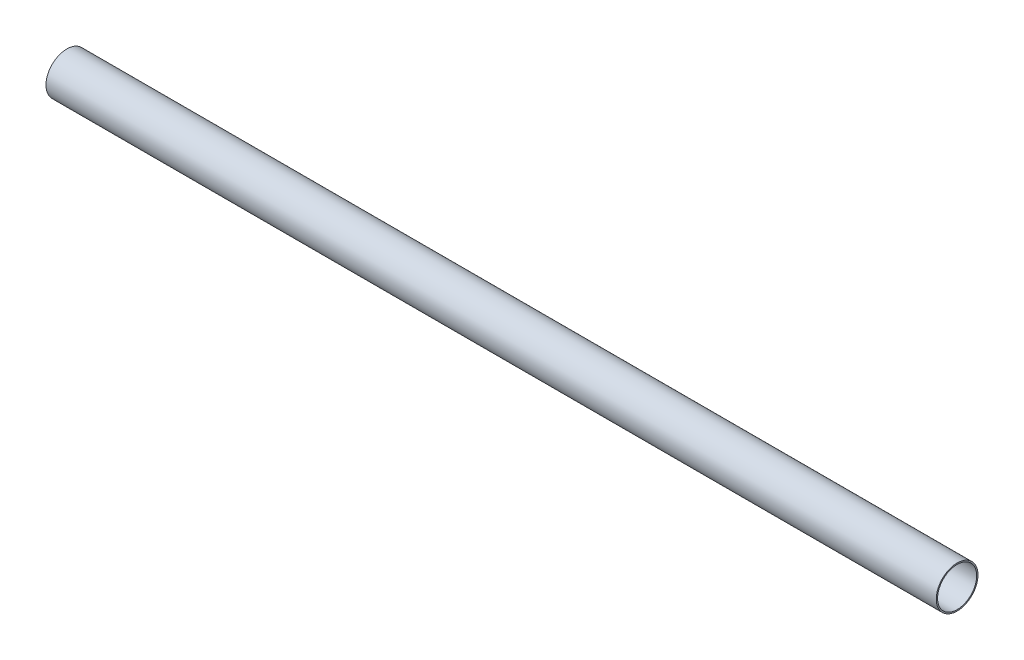
ISO-10303-21;
HEADER;
FILE_DESCRIPTION(('STEP AP214'),'2;1');
FILE_NAME('part.step','',(''),(''),'','','');
FILE_SCHEMA(('AUTOMOTIVE_DESIGN { 1 0 10303 214 1 1 1 1 }'));
ENDSEC;
DATA;
#1=APPLICATION_CONTEXT('core data for automotive mechanical design processes');
#2=APPLICATION_PROTOCOL_DEFINITION('international standard','automotive_design',2000,#1);
#3=PRODUCT_CONTEXT('',#1,'mechanical');
#4=PRODUCT('Part','Part','',(#3));
#5=PRODUCT_RELATED_PRODUCT_CATEGORY('part','',(#4));
#6=PRODUCT_DEFINITION_FORMATION('','',#4);
#7=PRODUCT_DEFINITION_CONTEXT('part definition',#1,'design');
#8=PRODUCT_DEFINITION('design','',#6,#7);
#9=PRODUCT_DEFINITION_SHAPE('','',#8);
#10=(LENGTH_UNIT() NAMED_UNIT(*) SI_UNIT(.MILLI.,.METRE.));
#11=(NAMED_UNIT(*) PLANE_ANGLE_UNIT() SI_UNIT($,.RADIAN.));
#12=(NAMED_UNIT(*) SI_UNIT($,.STERADIAN.) SOLID_ANGLE_UNIT());
#13=UNCERTAINTY_MEASURE_WITH_UNIT(LENGTH_MEASURE(1.E-05),#10,'distance_accuracy_value','');
#14=(GEOMETRIC_REPRESENTATION_CONTEXT(3) GLOBAL_UNCERTAINTY_ASSIGNED_CONTEXT((#13)) GLOBAL_UNIT_ASSIGNED_CONTEXT((#10,
#11,#12)) REPRESENTATION_CONTEXT('',''));
#15=CARTESIAN_POINT('',(0.,0.,0.));
#16=DIRECTION('',(0.,0.,1.));
#17=DIRECTION('',(1.,0.,0.));
#18=AXIS2_PLACEMENT_3D('',#15,#16,#17);
#19=CARTESIAN_POINT('',(304.8,0.,0.));
#20=DIRECTION('',(1.,0.,0.));
#21=DIRECTION('',(0.,0.,-1.));
#22=AXIS2_PLACEMENT_3D('',#19,#20,#21);
#23=PLANE('',#22);
#24=CARTESIAN_POINT('',(304.8,0.,0.));
#25=DIRECTION('',(1.,0.,0.));
#26=DIRECTION('',(0.,0.,-1.));
#27=AXIS2_PLACEMENT_3D('',#24,#25,#26);
#28=CIRCLE('',#27,14.2875);
#29=CARTESIAN_POINT('',(304.8,0.,-14.2875));
#30=VERTEX_POINT('',#29);
#31=EDGE_CURVE('E10',#30,#30,#28,.T.);
#32=ORIENTED_EDGE('',*,*,#31,.T.);
#33=EDGE_LOOP('',(#32));
#34=FACE_BOUND('',#33,.T.);
#35=CARTESIAN_POINT('',(304.8,0.,0.));
#36=DIRECTION('',(1.,0.,0.));
#37=DIRECTION('',(0.,0.,-1.));
#38=AXIS2_PLACEMENT_3D('',#35,#36,#37);
#39=CIRCLE('',#38,13.3985);
#40=CARTESIAN_POINT('',(304.8,0.,-13.3985));
#41=VERTEX_POINT('',#40);
#42=EDGE_CURVE('E41',#41,#41,#39,.T.);
#43=ORIENTED_EDGE('',*,*,#42,.F.);
#44=EDGE_LOOP('',(#43));
#45=FACE_BOUND('',#44,.T.);
#46=ADVANCED_FACE('F30',(#34,#45),#23,.T.);
#47=CARTESIAN_POINT('',(-304.8,0.,0.));
#48=DIRECTION('',(1.,0.,0.));
#49=DIRECTION('',(0.,0.,-1.));
#50=AXIS2_PLACEMENT_3D('',#47,#48,#49);
#51=PLANE('',#50);
#52=CARTESIAN_POINT('',(-304.8,0.,0.));
#53=DIRECTION('',(1.,0.,0.));
#54=DIRECTION('',(0.,0.,-1.));
#55=AXIS2_PLACEMENT_3D('',#52,#53,#54);
#56=CIRCLE('',#55,14.2875);
#57=CARTESIAN_POINT('',(-304.8,0.,-14.2875));
#58=VERTEX_POINT('',#57);
#59=EDGE_CURVE('E34',#58,#58,#56,.T.);
#60=ORIENTED_EDGE('',*,*,#59,.F.);
#61=EDGE_LOOP('',(#60));
#62=FACE_BOUND('',#61,.T.);
#63=CARTESIAN_POINT('',(-304.8,0.,0.));
#64=DIRECTION('',(1.,0.,0.));
#65=DIRECTION('',(0.,0.,-1.));
#66=AXIS2_PLACEMENT_3D('',#63,#64,#65);
#67=CIRCLE('',#66,13.3985);
#68=CARTESIAN_POINT('',(-304.8,0.,-13.3985));
#69=VERTEX_POINT('',#68);
#70=EDGE_CURVE('E43',#69,#69,#67,.T.);
#71=ORIENTED_EDGE('',*,*,#70,.T.);
#72=EDGE_LOOP('',(#71));
#73=FACE_BOUND('',#72,.T.);
#74=ADVANCED_FACE('F53',(#62,#73),#51,.F.);
#75=CARTESIAN_POINT('',(304.8,0.,0.));
#76=DIRECTION('',(-1.,0.,0.));
#77=DIRECTION('',(0.,0.,1.));
#78=AXIS2_PLACEMENT_3D('',#75,#76,#77);
#79=CYLINDRICAL_SURFACE('',#78,14.2875);
#80=ORIENTED_EDGE('',*,*,#31,.F.);
#81=EDGE_LOOP('',(#80));
#82=FACE_BOUND('',#81,.T.);
#83=ORIENTED_EDGE('',*,*,#59,.T.);
#84=EDGE_LOOP('',(#83));
#85=FACE_BOUND('',#84,.T.);
#86=ADVANCED_FACE('F32',(#82,#85),#79,.T.);
#87=CARTESIAN_POINT('',(304.8,0.,0.));
#88=DIRECTION('',(-1.,0.,0.));
#89=DIRECTION('',(0.,0.,1.));
#90=AXIS2_PLACEMENT_3D('',#87,#88,#89);
#91=CYLINDRICAL_SURFACE('',#90,13.3985);
#92=ORIENTED_EDGE('',*,*,#42,.T.);
#93=EDGE_LOOP('',(#92));
#94=FACE_BOUND('',#93,.T.);
#95=ORIENTED_EDGE('',*,*,#70,.F.);
#96=EDGE_LOOP('',(#95));
#97=FACE_BOUND('',#96,.T.);
#98=ADVANCED_FACE('F49',(#94,#97),#91,.F.);
#99=CLOSED_SHELL('',(#46,#74,#86,#98));
#100=MANIFOLD_SOLID_BREP('B2',#99);
#101=ADVANCED_BREP_SHAPE_REPRESENTATION('',(#18,#100),#14);
#102=SHAPE_DEFINITION_REPRESENTATION(#9,#101);
ENDSEC;
END-ISO-10303-21;
